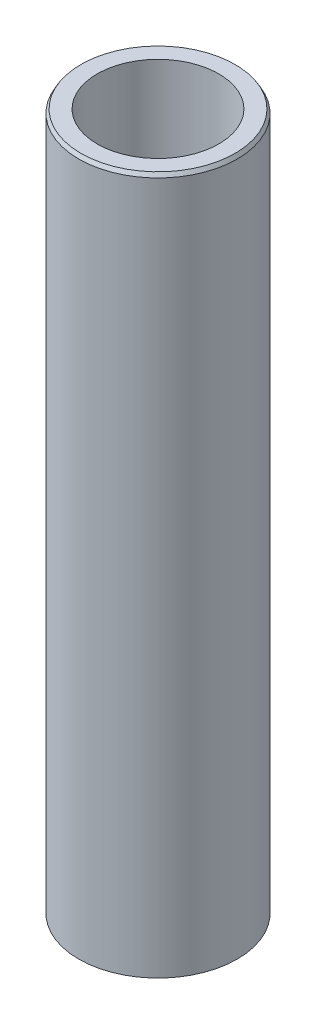
ISO-10303-21;
HEADER;
FILE_DESCRIPTION(('STEP AP214'),'2;1');
FILE_NAME('part.step','',(''),(''),'','','');
FILE_SCHEMA(('AUTOMOTIVE_DESIGN { 1 0 10303 214 1 1 1 1 }'));
ENDSEC;
DATA;
#1=APPLICATION_CONTEXT('core data for automotive mechanical design processes');
#2=APPLICATION_PROTOCOL_DEFINITION('international standard','automotive_design',2000,#1);
#3=PRODUCT_CONTEXT('',#1,'mechanical');
#4=PRODUCT('Part','Part','',(#3));
#5=PRODUCT_RELATED_PRODUCT_CATEGORY('part','',(#4));
#6=PRODUCT_DEFINITION_FORMATION('','',#4);
#7=PRODUCT_DEFINITION_CONTEXT('part definition',#1,'design');
#8=PRODUCT_DEFINITION('design','',#6,#7);
#9=PRODUCT_DEFINITION_SHAPE('','',#8);
#10=(LENGTH_UNIT() NAMED_UNIT(*) SI_UNIT(.MILLI.,.METRE.));
#11=(NAMED_UNIT(*) PLANE_ANGLE_UNIT() SI_UNIT($,.RADIAN.));
#12=(NAMED_UNIT(*) SI_UNIT($,.STERADIAN.) SOLID_ANGLE_UNIT());
#13=UNCERTAINTY_MEASURE_WITH_UNIT(LENGTH_MEASURE(1.E-05),#10,'distance_accuracy_value','');
#14=(GEOMETRIC_REPRESENTATION_CONTEXT(3) GLOBAL_UNCERTAINTY_ASSIGNED_CONTEXT((#13)) GLOBAL_UNIT_ASSIGNED_CONTEXT((#10,
#11,#12)) REPRESENTATION_CONTEXT('',''));
#15=CARTESIAN_POINT('',(0.,0.,0.));
#16=DIRECTION('',(0.,0.,1.));
#17=DIRECTION('',(1.,0.,0.));
#18=AXIS2_PLACEMENT_3D('',#15,#16,#17);
#19=CARTESIAN_POINT('',(0.,485.055794612401,0.));
#20=DIRECTION('',(0.,-1.,0.));
#21=DIRECTION('',(0.,0.,-1.));
#22=AXIS2_PLACEMENT_3D('',#19,#20,#21);
#23=CYLINDRICAL_SURFACE('',#22,55.);
#24=CARTESIAN_POINT('',(0.,482.426836565767,0.));
#25=DIRECTION('',(0.,1.,0.));
#26=DIRECTION('',(0.,0.,1.));
#27=AXIS2_PLACEMENT_3D('',#24,#25,#26);
#28=CIRCLE('',#27,55.);
#29=CARTESIAN_POINT('',(0.,482.426836565767,55.));
#30=VERTEX_POINT('',#29);
#31=EDGE_CURVE('E50',#30,#30,#28,.F.);
#32=ORIENTED_EDGE('',*,*,#31,.T.);
#33=EDGE_LOOP('',(#32));
#34=FACE_BOUND('',#33,.T.);
#35=CARTESIAN_POINT('',(0.,1.51782963591224,0.));
#36=DIRECTION('',(0.,1.,0.));
#37=DIRECTION('',(0.,0.,1.));
#38=AXIS2_PLACEMENT_3D('',#35,#36,#37);
#39=CIRCLE('',#38,55.);
#40=CARTESIAN_POINT('',(0.,1.51782963591224,55.));
#41=VERTEX_POINT('',#40);
#42=EDGE_CURVE('E51',#41,#41,#39,.T.);
#43=ORIENTED_EDGE('',*,*,#42,.T.);
#44=EDGE_LOOP('',(#43));
#45=FACE_BOUND('',#44,.T.);
#46=ADVANCED_FACE('F39',(#34,#45),#23,.T.);
#47=CARTESIAN_POINT('',(0.,485.055794612401,0.));
#48=DIRECTION('',(0.,1.,0.));
#49=DIRECTION('',(0.,0.,1.));
#50=AXIS2_PLACEMENT_3D('',#47,#48,#49);
#51=PLANE('',#50);
#52=CARTESIAN_POINT('',(0.,485.055794612401,0.));
#53=DIRECTION('',(0.,1.,0.));
#54=DIRECTION('',(0.,0.,1.));
#55=AXIS2_PLACEMENT_3D('',#52,#53,#54);
#56=CIRCLE('',#55,53.4821703640878);
#57=CARTESIAN_POINT('',(0.,485.055794612401,53.4821703640878));
#58=VERTEX_POINT('',#57);
#59=EDGE_CURVE('E54',#58,#58,#56,.T.);
#60=ORIENTED_EDGE('',*,*,#59,.T.);
#61=EDGE_LOOP('',(#60));
#62=FACE_BOUND('',#61,.T.);
#63=CARTESIAN_POINT('',(0.,485.055794612401,0.));
#64=DIRECTION('',(0.,1.,0.));
#65=DIRECTION('',(0.,0.,1.));
#66=AXIS2_PLACEMENT_3D('',#63,#64,#65);
#67=CIRCLE('',#66,42.1821784234504);
#68=CARTESIAN_POINT('',(0.,485.055794612401,42.1821784234504));
#69=VERTEX_POINT('',#68);
#70=EDGE_CURVE('E58',#69,#69,#67,.T.);
#71=ORIENTED_EDGE('',*,*,#70,.F.);
#72=EDGE_LOOP('',(#71));
#73=FACE_BOUND('',#72,.T.);
#74=ADVANCED_FACE('F69',(#62,#73),#51,.T.);
#75=CARTESIAN_POINT('',(0.,0.,0.));
#76=DIRECTION('',(0.,1.,0.));
#77=DIRECTION('',(0.,0.,1.));
#78=AXIS2_PLACEMENT_3D('',#75,#76,#77);
#79=PLANE('',#78);
#80=CARTESIAN_POINT('',(0.,0.,0.));
#81=DIRECTION('',(0.,1.,0.));
#82=DIRECTION('',(0.,0.,1.));
#83=AXIS2_PLACEMENT_3D('',#80,#81,#82);
#84=CIRCLE('',#83,52.3710419533663);
#85=CARTESIAN_POINT('',(0.,0.,52.3710419533663));
#86=VERTEX_POINT('',#85);
#87=EDGE_CURVE('E10',#86,#86,#84,.F.);
#88=ORIENTED_EDGE('',*,*,#87,.T.);
#89=EDGE_LOOP('',(#88));
#90=FACE_BOUND('',#89,.T.);
#91=CARTESIAN_POINT('',(0.,0.,0.));
#92=DIRECTION('',(0.,1.,0.));
#93=DIRECTION('',(0.,0.,1.));
#94=AXIS2_PLACEMENT_3D('',#91,#92,#93);
#95=CIRCLE('',#94,42.1821784234504);
#96=CARTESIAN_POINT('',(0.,0.,42.1821784234504));
#97=VERTEX_POINT('',#96);
#98=EDGE_CURVE('E63',#97,#97,#95,.T.);
#99=ORIENTED_EDGE('',*,*,#98,.T.);
#100=EDGE_LOOP('',(#99));
#101=FACE_BOUND('',#100,.T.);
#102=ADVANCED_FACE('F75',(#90,#101),#79,.F.);
#103=CARTESIAN_POINT('',(0.,485.055794612401,0.));
#104=DIRECTION('',(0.,-1.,0.));
#105=DIRECTION('',(0.,0.,-1.));
#106=AXIS2_PLACEMENT_3D('',#103,#104,#105);
#107=CYLINDRICAL_SURFACE('',#106,42.1821784234504);
#108=ORIENTED_EDGE('',*,*,#70,.T.);
#109=EDGE_LOOP('',(#108));
#110=FACE_BOUND('',#109,.T.);
#111=ORIENTED_EDGE('',*,*,#98,.F.);
#112=EDGE_LOOP('',(#111));
#113=FACE_BOUND('',#112,.T.);
#114=ADVANCED_FACE('F70',(#110,#113),#107,.F.);
#115=CARTESIAN_POINT('',(0.,485.055794612401,0.));
#116=DIRECTION('',(0.,-1.,0.));
#117=DIRECTION('',(0.,0.,-1.));
#118=AXIS2_PLACEMENT_3D('',#115,#116,#117);
#119=CONICAL_SURFACE('',#118,53.4821703640878,0.523598775598292);
#120=ORIENTED_EDGE('',*,*,#31,.F.);
#121=EDGE_LOOP('',(#120));
#122=FACE_BOUND('',#121,.T.);
#123=ORIENTED_EDGE('',*,*,#59,.F.);
#124=EDGE_LOOP('',(#123));
#125=FACE_BOUND('',#124,.T.);
#126=ADVANCED_FACE('F81',(#122,#125),#119,.T.);
#127=CARTESIAN_POINT('',(0.,1.51782963591224,0.));
#128=DIRECTION('',(0.,1.,0.));
#129=DIRECTION('',(0.,0.,1.));
#130=AXIS2_PLACEMENT_3D('',#127,#128,#129);
#131=CONICAL_SURFACE('',#130,55.,1.04719755119659);
#132=ORIENTED_EDGE('',*,*,#87,.F.);
#133=EDGE_LOOP('',(#132));
#134=FACE_BOUND('',#133,.T.);
#135=ORIENTED_EDGE('',*,*,#42,.F.);
#136=EDGE_LOOP('',(#135));
#137=FACE_BOUND('',#136,.T.);
#138=ADVANCED_FACE('F45',(#134,#137),#131,.T.);
#139=CLOSED_SHELL('',(#46,#74,#102,#114,#126,#138));
#140=MANIFOLD_SOLID_BREP('B2',#139);
#141=ADVANCED_BREP_SHAPE_REPRESENTATION('',(#18,#140),#14);
#142=SHAPE_DEFINITION_REPRESENTATION(#9,#141);
ENDSEC;
END-ISO-10303-21;
